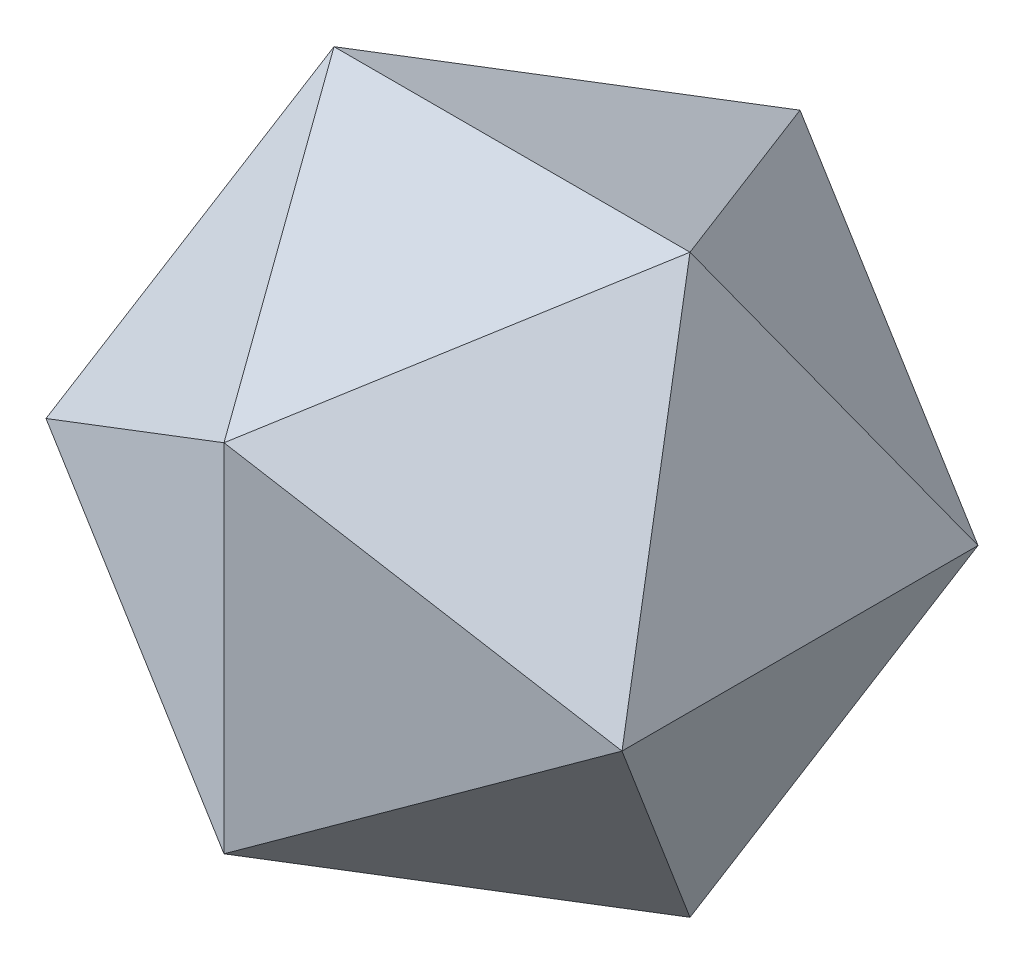
ISO-10303-21;
HEADER;
FILE_DESCRIPTION(('STEP AP214'),'2;1');
FILE_NAME('part.step','',(''),(''),'','','');
FILE_SCHEMA(('AUTOMOTIVE_DESIGN { 1 0 10303 214 1 1 1 1 }'));
ENDSEC;
DATA;
#1=APPLICATION_CONTEXT('core data for automotive mechanical design processes');
#2=APPLICATION_PROTOCOL_DEFINITION('international standard','automotive_design',2000,#1);
#3=PRODUCT_CONTEXT('',#1,'mechanical');
#4=PRODUCT('Part','Part','',(#3));
#5=PRODUCT_RELATED_PRODUCT_CATEGORY('part','',(#4));
#6=PRODUCT_DEFINITION_FORMATION('','',#4);
#7=PRODUCT_DEFINITION_CONTEXT('part definition',#1,'design');
#8=PRODUCT_DEFINITION('design','',#6,#7);
#9=PRODUCT_DEFINITION_SHAPE('','',#8);
#10=(LENGTH_UNIT() NAMED_UNIT(*) SI_UNIT(.MILLI.,.METRE.));
#11=(NAMED_UNIT(*) PLANE_ANGLE_UNIT() SI_UNIT($,.RADIAN.));
#12=(NAMED_UNIT(*) SI_UNIT($,.STERADIAN.) SOLID_ANGLE_UNIT());
#13=UNCERTAINTY_MEASURE_WITH_UNIT(LENGTH_MEASURE(1.E-05),#10,'distance_accuracy_value','');
#14=(GEOMETRIC_REPRESENTATION_CONTEXT(3) GLOBAL_UNCERTAINTY_ASSIGNED_CONTEXT((#13)) GLOBAL_UNIT_ASSIGNED_CONTEXT((#10,
#11,#12)) REPRESENTATION_CONTEXT('',''));
#15=CARTESIAN_POINT('',(0.,0.,0.));
#16=DIRECTION('',(0.,0.,1.));
#17=DIRECTION('',(1.,0.,0.));
#18=AXIS2_PLACEMENT_3D('',#15,#16,#17);
#19=CARTESIAN_POINT('',(-28.3155948031232,0.,17.4999999999999));
#20=DIRECTION('',(0.934172358962716,-0.35682208977309,0.));
#21=DIRECTION('',(0.35682208977309,0.934172358962716,0.));
#22=AXIS2_PLACEMENT_3D('',#19,#20,#21);
#23=PLANE('',#22);
#24=DIRECTION('',(0.30901699437495,0.809016994374947,-0.499999999999999));
#25=VECTOR('',#24,1.);
#26=CARTESIAN_POINT('',(-17.5,28.3155948031232,0.));
#27=LINE('',#26,#25);
#28=CARTESIAN_POINT('',(-28.3155948031231,-1.08324059051696E-13,17.5000000000001));
#29=VERTEX_POINT('',#28);
#30=CARTESIAN_POINT('',(-17.5,28.3155948031232,0.));
#31=VERTEX_POINT('',#30);
#32=EDGE_CURVE('E306',#29,#31,#27,.T.);
#33=ORIENTED_EDGE('',*,*,#32,.T.);
#34=DIRECTION('',(-0.309016994374945,-0.809016994374946,-0.500000000000003));
#35=VECTOR('',#34,1.);
#36=CARTESIAN_POINT('',(-28.3155948031231,0.,-17.5000000000001));
#37=LINE('',#36,#35);
#38=CARTESIAN_POINT('',(-28.3155948031232,1.03119888623764E-13,-17.4999999999999));
#39=VERTEX_POINT('',#38);
#40=EDGE_CURVE('E106',#31,#39,#37,.T.);
#41=ORIENTED_EDGE('',*,*,#40,.T.);
#42=DIRECTION('',(0.,0.,-1.));
#43=VECTOR('',#42,1.);
#44=CARTESIAN_POINT('',(-28.3155948031232,1.04854612099741E-13,-17.4999999999999));
#45=LINE('',#44,#43);
#46=EDGE_CURVE('E191',#29,#39,#45,.T.);
#47=ORIENTED_EDGE('',*,*,#46,.F.);
#48=EDGE_LOOP('',(#33,#41,#47));
#49=FACE_BOUND('',#48,.T.);
#50=ADVANCED_FACE('F39',(#49),#23,.F.);
#51=CARTESIAN_POINT('',(-28.3155948031232,0.,17.4999999999999));
#52=DIRECTION('',(0.577350269189625,-0.577350269189626,-0.577350269189626));
#53=DIRECTION('',(-0.110264089708265,0.645497224367905,-0.75576131407617));
#54=AXIS2_PLACEMENT_3D('',#51,#52,#53);
#55=PLANE('',#54);
#56=ORIENTED_EDGE('',*,*,#32,.F.);
#57=DIRECTION('',(-0.809016994374948,-0.499999999999997,-0.30901699437495));
#58=VECTOR('',#57,1.);
#59=CARTESIAN_POINT('',(-28.3155948031232,0.,17.4999999999999));
#60=LINE('',#59,#58);
#61=CARTESIAN_POINT('',(0.,17.5,28.3155948031232));
#62=VERTEX_POINT('',#61);
#63=EDGE_CURVE('E387',#62,#29,#60,.T.);
#64=ORIENTED_EDGE('',*,*,#63,.F.);
#65=DIRECTION('',(0.5,-0.309016994374948,0.809016994374948));
#66=VECTOR('',#65,1.);
#67=CARTESIAN_POINT('',(0.,17.5,28.3155948031232));
#68=LINE('',#67,#66);
#69=EDGE_CURVE('E496',#31,#62,#68,.T.);
#70=ORIENTED_EDGE('',*,*,#69,.F.);
#71=EDGE_LOOP('',(#56,#64,#70));
#72=FACE_BOUND('',#71,.T.);
#73=ADVANCED_FACE('F336',(#72),#55,.F.);
#74=CARTESIAN_POINT('',(17.5000000000003,-28.315594803123,-2.65380957269791E-13));
#75=DIRECTION('',(-0.934172358962719,0.356822089773081,0.));
#76=DIRECTION('',(0.178411044886541,0.467086179481368,-0.866025403784434));
#77=AXIS2_PLACEMENT_3D('',#74,#75,#76);
#78=PLANE('',#77);
#79=DIRECTION('',(0.30901699437494,0.809016994374954,-0.499999999999994));
#80=VECTOR('',#79,1.);
#81=CARTESIAN_POINT('',(28.3155948031232,3.42511728308564E-13,-17.5));
#82=LINE('',#81,#80);
#83=CARTESIAN_POINT('',(17.4999999999997,-28.3155948031234,-1.17961196366423E-13));
#84=VERTEX_POINT('',#83);
#85=CARTESIAN_POINT('',(28.3155948031232,3.42511728308564E-13,-17.5));
#86=VERTEX_POINT('',#85);
#87=EDGE_CURVE('E185',#84,#86,#82,.T.);
#88=ORIENTED_EDGE('',*,*,#87,.T.);
#89=DIRECTION('',(0.,0.,1.));
#90=VECTOR('',#89,1.);
#91=CARTESIAN_POINT('',(28.3155948031232,1.2239416325322E-13,17.5));
#92=LINE('',#91,#90);
#93=CARTESIAN_POINT('',(28.3155948031232,1.2239416325322E-13,17.5));
#94=VERTEX_POINT('',#93);
#95=EDGE_CURVE('E298',#86,#94,#92,.T.);
#96=ORIENTED_EDGE('',*,*,#95,.T.);
#97=DIRECTION('',(-0.30901699437494,-0.809016994374946,-0.500000000000008));
#98=VECTOR('',#97,1.);
#99=CARTESIAN_POINT('',(17.5000000000003,-28.315594803123,-2.65380957269791E-13));
#100=LINE('',#99,#98);
#101=EDGE_CURVE('E44',#94,#84,#100,.T.);
#102=ORIENTED_EDGE('',*,*,#101,.T.);
#103=EDGE_LOOP('',(#88,#96,#102));
#104=FACE_BOUND('',#103,.T.);
#105=ADVANCED_FACE('F326',(#104),#78,.F.);
#106=CARTESIAN_POINT('',(17.5000000000003,-28.315594803123,-2.72319851173698E-13));
#107=DIRECTION('',(-0.577350269189628,0.577350269189617,0.577350269189633));
#108=DIRECTION('',(0.645497224367896,0.755761314076177,-0.110264089708264));
#109=AXIS2_PLACEMENT_3D('',#106,#107,#108);
#110=PLANE('',#109);
#111=ORIENTED_EDGE('',*,*,#87,.F.);
#112=DIRECTION('',(-0.500000000000002,0.309016994374952,-0.809016994374945));
#113=VECTOR('',#112,1.);
#114=CARTESIAN_POINT('',(0.,-17.4999999999998,-28.3155948031233));
#115=LINE('',#114,#113);
#116=CARTESIAN_POINT('',(0.,-17.4999999999998,-28.3155948031233));
#117=VERTEX_POINT('',#116);
#118=EDGE_CURVE('E651',#84,#117,#115,.T.);
#119=ORIENTED_EDGE('',*,*,#118,.T.);
#120=DIRECTION('',(-0.809016994374945,-0.500000000000002,-0.309016994374951));
#121=VECTOR('',#120,1.);
#122=CARTESIAN_POINT('',(0.,-17.4999999999998,-28.3155948031233));
#123=LINE('',#122,#121);
#124=EDGE_CURVE('E152',#86,#117,#123,.T.);
#125=ORIENTED_EDGE('',*,*,#124,.F.);
#126=EDGE_LOOP('',(#111,#119,#125));
#127=FACE_BOUND('',#126,.T.);
#128=ADVANCED_FACE('F335',(#127),#110,.F.);
#129=CARTESIAN_POINT('',(17.5000000000003,28.315594803123,0.));
#130=DIRECTION('',(-0.934172358962719,-0.356822089773081,0.));
#131=DIRECTION('',(0.178411044886541,-0.467086179481362,0.866025403784437));
#132=AXIS2_PLACEMENT_3D('',#129,#130,#131);
#133=PLANE('',#132);
#134=DIRECTION('',(0.30901699437494,-0.809016994374951,0.499999999999999));
#135=VECTOR('',#134,1.);
#136=CARTESIAN_POINT('',(28.3155948031232,-2.20309881449055E-13,17.5));
#137=LINE('',#136,#135);
#138=CARTESIAN_POINT('',(17.4999999999997,28.3155948031234,3.15687938073121E-13));
#139=VERTEX_POINT('',#138);
#140=EDGE_CURVE('E113',#139,#94,#137,.T.);
#141=ORIENTED_EDGE('',*,*,#140,.T.);
#142=ORIENTED_EDGE('',*,*,#95,.F.);
#143=DIRECTION('',(-0.30901699437494,0.809016994374949,0.500000000000002));
#144=VECTOR('',#143,1.);
#145=CARTESIAN_POINT('',(17.5000000000003,28.315594803123,0.));
#146=LINE('',#145,#144);
#147=EDGE_CURVE('E143',#86,#139,#146,.T.);
#148=ORIENTED_EDGE('',*,*,#147,.T.);
#149=EDGE_LOOP('',(#141,#142,#148));
#150=FACE_BOUND('',#149,.T.);
#151=ADVANCED_FACE('F680',(#150),#133,.F.);
#152=CARTESIAN_POINT('',(17.5000000000003,28.315594803123,0.));
#153=DIRECTION('',(-0.577350269189628,-0.577350269189621,-0.577350269189629));
#154=DIRECTION('',(0.645497224367896,-0.755761314076176,0.110264089708269));
#155=AXIS2_PLACEMENT_3D('',#152,#153,#154);
#156=PLANE('',#155);
#157=ORIENTED_EDGE('',*,*,#140,.F.);
#158=DIRECTION('',(0.500000000000006,0.309016994374944,-0.809016994374945));
#159=VECTOR('',#158,1.);
#160=CARTESIAN_POINT('',(17.5000000000003,28.315594803123,0.));
#161=LINE('',#160,#159);
#162=EDGE_CURVE('E498',#62,#139,#161,.T.);
#163=ORIENTED_EDGE('',*,*,#162,.F.);
#164=DIRECTION('',(-0.809016994374945,0.500000000000004,0.309016994374948));
#165=VECTOR('',#164,1.);
#166=CARTESIAN_POINT('',(0.,17.5,28.3155948031232));
#167=LINE('',#166,#165);
#168=EDGE_CURVE('E558',#94,#62,#167,.T.);
#169=ORIENTED_EDGE('',*,*,#168,.F.);
#170=EDGE_LOOP('',(#157,#163,#169));
#171=FACE_BOUND('',#170,.T.);
#172=ADVANCED_FACE('F534',(#171),#156,.F.);
#173=CARTESIAN_POINT('',(-4.23272528138341E-13,17.5000000000003,-28.315594803123));
#174=DIRECTION('',(0.577350269189637,-0.577350269189627,0.577350269189614));
#175=DIRECTION('',(-0.645497224367897,-0.755761314076176,-0.11026408970827));
#176=AXIS2_PLACEMENT_3D('',#173,#174,#175);
#177=PLANE('',#176);
#178=DIRECTION('',(-0.809016994374939,-0.500000000000012,0.309016994374949));
#179=VECTOR('',#178,1.);
#180=CARTESIAN_POINT('',(-28.3155948031233,0.,-17.4999999999998));
#181=LINE('',#180,#179);
#182=CARTESIAN_POINT('',(1.23165366794353E-13,17.4999999999999,-28.3155948031232));
#183=VERTEX_POINT('',#182);
#184=EDGE_CURVE('E103',#183,#39,#181,.T.);
#185=ORIENTED_EDGE('',*,*,#184,.T.);
#186=ORIENTED_EDGE('',*,*,#40,.F.);
#187=DIRECTION('',(0.499999999999995,-0.309016994374933,-0.809016994374956));
#188=VECTOR('',#187,1.);
#189=CARTESIAN_POINT('',(-4.23272528138341E-13,17.5000000000003,-28.315594803123));
#190=LINE('',#189,#188);
#191=EDGE_CURVE('E99',#31,#183,#190,.T.);
#192=ORIENTED_EDGE('',*,*,#191,.T.);
#193=EDGE_LOOP('',(#185,#186,#192));
#194=FACE_BOUND('',#193,.T.);
#195=ADVANCED_FACE('F102',(#194),#177,.F.);
#196=CARTESIAN_POINT('',(-4.21537804662364E-13,17.5000000000003,-28.315594803123));
#197=DIRECTION('',(0.356822089773097,0.,0.934172358962713));
#198=DIRECTION('',(-0.934172358962713,0.,0.356822089773097));
#199=AXIS2_PLACEMENT_3D('',#196,#197,#198);
#200=PLANE('',#199);
#201=ORIENTED_EDGE('',*,*,#184,.F.);
#202=DIRECTION('',(0.,1.,0.));
#203=VECTOR('',#202,1.);
#204=CARTESIAN_POINT('',(-4.21537804662364E-13,17.5000000000003,-28.315594803123));
#205=LINE('',#204,#203);
#206=EDGE_CURVE('E114',#117,#183,#205,.T.);
#207=ORIENTED_EDGE('',*,*,#206,.F.);
#208=DIRECTION('',(-0.809016994374948,0.499999999999995,0.309016994374954));
#209=VECTOR('',#208,1.);
#210=CARTESIAN_POINT('',(-28.3155948031232,1.03119888623764E-13,-17.4999999999999));
#211=LINE('',#210,#209);
#212=EDGE_CURVE('E128',#117,#39,#211,.T.);
#213=ORIENTED_EDGE('',*,*,#212,.T.);
#214=EDGE_LOOP('',(#201,#207,#213));
#215=FACE_BOUND('',#214,.T.);
#216=ADVANCED_FACE('F123',(#215),#200,.F.);
#217=CARTESIAN_POINT('',(-17.4999999999999,28.3155948031233,0.));
#218=DIRECTION('',(0.,-0.934172358962715,0.356822089773092));
#219=DIRECTION('',(0.866025403784439,0.178411044886541,0.467086179481358));
#220=AXIS2_PLACEMENT_3D('',#217,#218,#219);
#221=PLANE('',#220);
#222=DIRECTION('',(1.,0.,0.));
#223=VECTOR('',#222,1.);
#224=CARTESIAN_POINT('',(17.5000000000001,28.3155948031231,0.));
#225=LINE('',#224,#223);
#226=EDGE_CURVE('E159',#31,#139,#225,.T.);
#227=ORIENTED_EDGE('',*,*,#226,.T.);
#228=DIRECTION('',(-0.499999999999999,-0.309016994374947,-0.809016994374949));
#229=VECTOR('',#228,1.);
#230=CARTESIAN_POINT('',(1.23165366794353E-13,17.4999999999999,-28.3155948031232));
#231=LINE('',#230,#229);
#232=EDGE_CURVE('E140',#139,#183,#231,.T.);
#233=ORIENTED_EDGE('',*,*,#232,.T.);
#234=ORIENTED_EDGE('',*,*,#191,.F.);
#235=EDGE_LOOP('',(#227,#233,#234));
#236=FACE_BOUND('',#235,.T.);
#237=ADVANCED_FACE('F158',(#236),#221,.F.);
#238=CARTESIAN_POINT('',(-17.4999999999999,28.3155948031233,0.));
#239=DIRECTION('',(0.,-0.934172358962715,-0.356822089773091));
#240=DIRECTION('',(0.866025403784441,0.178411044886541,-0.467086179481355));
#241=AXIS2_PLACEMENT_3D('',#238,#239,#240);
#242=PLANE('',#241);
#243=ORIENTED_EDGE('',*,*,#226,.F.);
#244=ORIENTED_EDGE('',*,*,#69,.T.);
#245=ORIENTED_EDGE('',*,*,#162,.T.);
#246=EDGE_LOOP('',(#243,#244,#245));
#247=FACE_BOUND('',#246,.T.);
#248=ADVANCED_FACE('F464',(#247),#242,.F.);
#249=CARTESIAN_POINT('',(28.3155948031231,4.88228500290617E-13,-17.5000000000001));
#250=DIRECTION('',(-0.577350269189618,-0.577350269189639,0.577350269189621));
#251=DIRECTION('',(-0.755761314076175,0.110264089708269,-0.645497224367898));
#252=AXIS2_PLACEMENT_3D('',#249,#250,#251);
#253=PLANE('',#252);
#254=DIRECTION('',(-0.809016994374954,0.499999999999995,-0.309016994374938));
#255=VECTOR('',#254,1.);
#256=CARTESIAN_POINT('',(-2.67147415300428E-13,17.5000000000003,-28.315594803123));
#257=LINE('',#256,#255);
#258=EDGE_CURVE('E130',#86,#183,#257,.T.);
#259=ORIENTED_EDGE('',*,*,#258,.T.);
#260=ORIENTED_EDGE('',*,*,#232,.F.);
#261=ORIENTED_EDGE('',*,*,#147,.F.);
#262=EDGE_LOOP('',(#259,#260,#261));
#263=FACE_BOUND('',#262,.T.);
#264=ADVANCED_FACE('F139',(#263),#253,.F.);
#265=CARTESIAN_POINT('',(28.3155948031231,4.8128960638671E-13,-17.5000000000001));
#266=DIRECTION('',(-0.356822089773085,0.,0.934172358962718));
#267=DIRECTION('',(-0.467086179481369,0.866025403784435,-0.178411044886535));
#268=AXIS2_PLACEMENT_3D('',#265,#266,#267);
#269=PLANE('',#268);
#270=ORIENTED_EDGE('',*,*,#258,.F.);
#271=ORIENTED_EDGE('',*,*,#124,.T.);
#272=ORIENTED_EDGE('',*,*,#206,.T.);
#273=EDGE_LOOP('',(#270,#271,#272));
#274=FACE_BOUND('',#273,.T.);
#275=ADVANCED_FACE('F151',(#274),#269,.F.);
#276=CARTESIAN_POINT('',(-4.23272528138341E-13,-17.5000000000001,28.3155948031231));
#277=DIRECTION('',(0.577350269189637,0.577350269189623,-0.577350269189618));
#278=DIRECTION('',(-0.645497224367897,0.755761314076176,0.110264089708265));
#279=AXIS2_PLACEMENT_3D('',#276,#277,#278);
#280=PLANE('',#279);
#281=DIRECTION('',(-0.809016994374939,0.50000000000001,-0.309016994374952));
#282=VECTOR('',#281,1.);
#283=CARTESIAN_POINT('',(-28.3155948031233,2.22044604925031E-13,17.4999999999998));
#284=LINE('',#283,#282);
#285=CARTESIAN_POINT('',(-2.67147415300428E-13,-17.5000000000001,28.3155948031231));
#286=VERTEX_POINT('',#285);
#287=EDGE_CURVE('E373',#286,#29,#284,.T.);
#288=ORIENTED_EDGE('',*,*,#287,.T.);
#289=DIRECTION('',(-0.309016994374945,0.809016994374943,0.500000000000009));
#290=VECTOR('',#289,1.);
#291=CARTESIAN_POINT('',(-28.3155948031231,-1.08324059051696E-13,17.5000000000001));
#292=LINE('',#291,#290);
#293=CARTESIAN_POINT('',(-17.5,-28.3155948031232,-1.97726741706696E-13));
#294=VERTEX_POINT('',#293);
#295=EDGE_CURVE('E50',#294,#29,#292,.T.);
#296=ORIENTED_EDGE('',*,*,#295,.F.);
#297=DIRECTION('',(-0.499999999999999,-0.309016994374946,-0.809016994374949));
#298=VECTOR('',#297,1.);
#299=CARTESIAN_POINT('',(-17.4999999999999,-28.3155948031233,-1.4741976090337E-13));
#300=LINE('',#299,#298);
#301=EDGE_CURVE('E377',#286,#294,#300,.T.);
#302=ORIENTED_EDGE('',*,*,#301,.F.);
#303=EDGE_LOOP('',(#288,#296,#302));
#304=FACE_BOUND('',#303,.T.);
#305=ADVANCED_FACE('F401',(#304),#280,.F.);
#306=CARTESIAN_POINT('',(-4.21537804662364E-13,-17.5000000000001,28.3155948031231));
#307=DIRECTION('',(0.356822089773097,0.,-0.934172358962713));
#308=DIRECTION('',(-0.934172358962713,0.,-0.356822089773097));
#309=AXIS2_PLACEMENT_3D('',#306,#307,#308);
#310=PLANE('',#309);
#311=ORIENTED_EDGE('',*,*,#287,.F.);
#312=DIRECTION('',(0.,-1.,0.));
#313=VECTOR('',#312,1.);
#314=CARTESIAN_POINT('',(-4.21537804662364E-13,-17.5000000000001,28.3155948031231));
#315=LINE('',#314,#313);
#316=EDGE_CURVE('E58',#62,#286,#315,.T.);
#317=ORIENTED_EDGE('',*,*,#316,.F.);
#318=ORIENTED_EDGE('',*,*,#63,.T.);
#319=EDGE_LOOP('',(#311,#317,#318));
#320=FACE_BOUND('',#319,.T.);
#321=ADVANCED_FACE('F237',(#320),#310,.F.);
#322=CARTESIAN_POINT('',(-28.3155948031232,1.04854612099741E-13,-17.4999999999999));
#323=DIRECTION('',(0.934172358962716,0.35682208977309,0.));
#324=DIRECTION('',(0.35682208977309,-0.934172358962716,0.));
#325=AXIS2_PLACEMENT_3D('',#322,#323,#324);
#326=PLANE('',#325);
#327=DIRECTION('',(0.30901699437495,-0.809016994374951,0.499999999999993));
#328=VECTOR('',#327,1.);
#329=CARTESIAN_POINT('',(-17.5,-28.3155948031232,-1.97726741706696E-13));
#330=LINE('',#329,#328);
#331=EDGE_CURVE('E205',#39,#294,#330,.T.);
#332=ORIENTED_EDGE('',*,*,#331,.T.);
#333=ORIENTED_EDGE('',*,*,#295,.T.);
#334=ORIENTED_EDGE('',*,*,#46,.T.);
#335=EDGE_LOOP('',(#332,#333,#334));
#336=FACE_BOUND('',#335,.T.);
#337=ADVANCED_FACE('F227',(#336),#326,.F.);
#338=CARTESIAN_POINT('',(-28.3155948031232,1.03119888623764E-13,-17.4999999999999));
#339=DIRECTION('',(0.577350269189625,0.577350269189622,0.57735026918963));
#340=DIRECTION('',(-0.110264089708265,-0.64549722436791,0.755761314076165));
#341=AXIS2_PLACEMENT_3D('',#338,#339,#340);
#342=PLANE('',#341);
#343=ORIENTED_EDGE('',*,*,#331,.F.);
#344=ORIENTED_EDGE('',*,*,#212,.F.);
#345=DIRECTION('',(0.5,0.309016994374954,-0.809016994374945));
#346=VECTOR('',#345,1.);
#347=CARTESIAN_POINT('',(0.,-17.4999999999998,-28.3155948031233));
#348=LINE('',#347,#346);
#349=EDGE_CURVE('E188',#294,#117,#348,.T.);
#350=ORIENTED_EDGE('',*,*,#349,.F.);
#351=EDGE_LOOP('',(#343,#344,#350));
#352=FACE_BOUND('',#351,.T.);
#353=ADVANCED_FACE('F236',(#352),#342,.F.);
#354=CARTESIAN_POINT('',(-17.4999999999999,-28.3155948031233,-1.4741976090337E-13));
#355=DIRECTION('',(0.,0.934172358962718,-0.356822089773085));
#356=DIRECTION('',(0.866025403784439,-0.178411044886538,-0.467086179481359));
#357=AXIS2_PLACEMENT_3D('',#354,#355,#356);
#358=PLANE('',#357);
#359=DIRECTION('',(1.,0.,0.));
#360=VECTOR('',#359,1.);
#361=CARTESIAN_POINT('',(17.5000000000001,-28.3155948031231,-2.13339252990487E-13));
#362=LINE('',#361,#360);
#363=EDGE_CURVE('E638',#294,#84,#362,.T.);
#364=ORIENTED_EDGE('',*,*,#363,.T.);
#365=DIRECTION('',(-0.499999999999999,0.309016994374941,0.809016994374951));
#366=VECTOR('',#365,1.);
#367=CARTESIAN_POINT('',(1.23165366794353E-13,-17.5000000000001,28.3155948031231));
#368=LINE('',#367,#366);
#369=EDGE_CURVE('E65',#84,#286,#368,.T.);
#370=ORIENTED_EDGE('',*,*,#369,.T.);
#371=ORIENTED_EDGE('',*,*,#301,.T.);
#372=EDGE_LOOP('',(#364,#370,#371));
#373=FACE_BOUND('',#372,.T.);
#374=ADVANCED_FACE('F616',(#373),#358,.F.);
#375=CARTESIAN_POINT('',(-17.4999999999999,-28.3155948031233,-1.54358654807277E-13));
#376=DIRECTION('',(0.,0.934172358962713,0.356822089773098));
#377=DIRECTION('',(0.866025403784441,-0.178411044886544,0.467086179481354));
#378=AXIS2_PLACEMENT_3D('',#375,#376,#377);
#379=PLANE('',#378);
#380=ORIENTED_EDGE('',*,*,#363,.F.);
#381=ORIENTED_EDGE('',*,*,#349,.T.);
#382=ORIENTED_EDGE('',*,*,#118,.F.);
#383=EDGE_LOOP('',(#380,#381,#382));
#384=FACE_BOUND('',#383,.T.);
#385=ADVANCED_FACE('F601',(#384),#379,.F.);
#386=CARTESIAN_POINT('',(28.3155948031231,-3.66026653431106E-13,17.5000000000001));
#387=DIRECTION('',(-0.577350269189618,0.577350269189635,-0.577350269189625));
#388=DIRECTION('',(-0.755761314076175,-0.110264089708264,0.645497224367899));
#389=AXIS2_PLACEMENT_3D('',#386,#387,#388);
#390=PLANE('',#389);
#391=DIRECTION('',(-0.809016994374954,-0.499999999999993,0.309016994374942));
#392=VECTOR('',#391,1.);
#393=CARTESIAN_POINT('',(-2.67147415300428E-13,-17.5000000000001,28.3155948031231));
#394=LINE('',#393,#392);
#395=EDGE_CURVE('E12',#94,#286,#394,.T.);
#396=ORIENTED_EDGE('',*,*,#395,.T.);
#397=ORIENTED_EDGE('',*,*,#369,.F.);
#398=ORIENTED_EDGE('',*,*,#101,.F.);
#399=EDGE_LOOP('',(#396,#397,#398));
#400=FACE_BOUND('',#399,.T.);
#401=ADVANCED_FACE('F41',(#400),#390,.F.);
#402=CARTESIAN_POINT('',(28.3155948031231,-3.59087759527199E-13,17.5000000000001));
#403=DIRECTION('',(-0.356822089773085,0.,-0.934172358962718));
#404=DIRECTION('',(-0.467086179481369,-0.866025403784434,0.178411044886541));
#405=AXIS2_PLACEMENT_3D('',#402,#403,#404);
#406=PLANE('',#405);
#407=ORIENTED_EDGE('',*,*,#395,.F.);
#408=ORIENTED_EDGE('',*,*,#168,.T.);
#409=ORIENTED_EDGE('',*,*,#316,.T.);
#410=EDGE_LOOP('',(#407,#408,#409));
#411=FACE_BOUND('',#410,.T.);
#412=ADVANCED_FACE('F239',(#411),#406,.F.);
#413=CLOSED_SHELL('',(#50,#73,#105,#128,#151,#172,#195,#216,#237,#248,#264,#275,#305,#321,#337,
#353,#374,#385,#401,#412));
#414=MANIFOLD_SOLID_BREP('B2',#413);
#415=ADVANCED_BREP_SHAPE_REPRESENTATION('',(#18,#414),#14);
#416=SHAPE_DEFINITION_REPRESENTATION(#9,#415);
ENDSEC;
END-ISO-10303-21;
